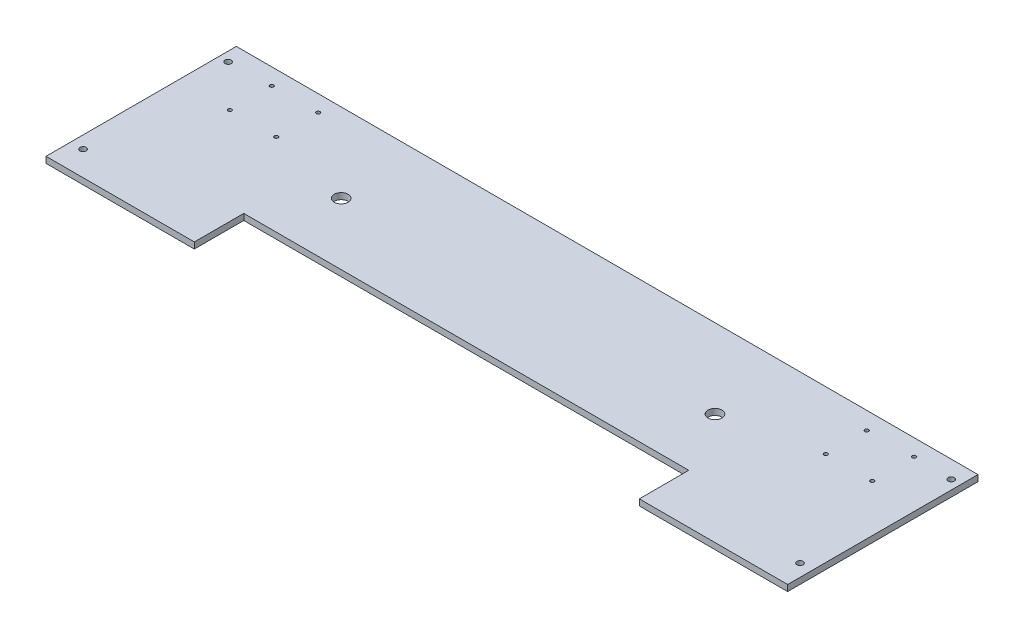
ISO-10303-21;
HEADER;
FILE_DESCRIPTION(('STEP AP214'),'2;1');
FILE_NAME('part.step','',(''),(''),'','','');
FILE_SCHEMA(('AUTOMOTIVE_DESIGN { 1 0 10303 214 1 1 1 1 }'));
ENDSEC;
DATA;
#1=APPLICATION_CONTEXT('core data for automotive mechanical design processes');
#2=APPLICATION_PROTOCOL_DEFINITION('international standard','automotive_design',2000,#1);
#3=PRODUCT_CONTEXT('',#1,'mechanical');
#4=PRODUCT('Part','Part','',(#3));
#5=PRODUCT_RELATED_PRODUCT_CATEGORY('part','',(#4));
#6=PRODUCT_DEFINITION_FORMATION('','',#4);
#7=PRODUCT_DEFINITION_CONTEXT('part definition',#1,'design');
#8=PRODUCT_DEFINITION('design','',#6,#7);
#9=PRODUCT_DEFINITION_SHAPE('','',#8);
#10=(LENGTH_UNIT() NAMED_UNIT(*) SI_UNIT(.MILLI.,.METRE.));
#11=(NAMED_UNIT(*) PLANE_ANGLE_UNIT() SI_UNIT($,.RADIAN.));
#12=(NAMED_UNIT(*) SI_UNIT($,.STERADIAN.) SOLID_ANGLE_UNIT());
#13=UNCERTAINTY_MEASURE_WITH_UNIT(LENGTH_MEASURE(1.E-05),#10,'distance_accuracy_value','');
#14=(GEOMETRIC_REPRESENTATION_CONTEXT(3) GLOBAL_UNCERTAINTY_ASSIGNED_CONTEXT((#13)) GLOBAL_UNIT_ASSIGNED_CONTEXT((#10,
#11,#12)) REPRESENTATION_CONTEXT('',''));
#15=CARTESIAN_POINT('',(0.,0.,0.));
#16=DIRECTION('',(0.,0.,1.));
#17=DIRECTION('',(1.,0.,0.));
#18=AXIS2_PLACEMENT_3D('',#15,#16,#17);
#19=CARTESIAN_POINT('',(609.6,6.35,50.7999999999986));
#20=DIRECTION('',(-1.,0.,0.));
#21=DIRECTION('',(0.,0.,1.));
#22=AXIS2_PLACEMENT_3D('',#19,#20,#21);
#23=PLANE('',#22);
#24=DIRECTION('',(0.,0.,-1.));
#25=VECTOR('',#24,1.);
#26=CARTESIAN_POINT('',(609.6,0.,50.7999999999986));
#27=LINE('',#26,#25);
#28=CARTESIAN_POINT('',(609.6,0.,50.7999999999986));
#29=VERTEX_POINT('',#28);
#30=CARTESIAN_POINT('',(609.6,0.,-144.780000000001));
#31=VERTEX_POINT('',#30);
#32=EDGE_CURVE('E131',#29,#31,#27,.T.);
#33=ORIENTED_EDGE('',*,*,#32,.T.);
#34=DIRECTION('',(0.,-1.,0.));
#35=VECTOR('',#34,1.);
#36=CARTESIAN_POINT('',(609.6,6.35,-144.780000000001));
#37=LINE('',#36,#35);
#38=CARTESIAN_POINT('',(609.6,6.35,-144.780000000001));
#39=VERTEX_POINT('',#38);
#40=EDGE_CURVE('E11',#39,#31,#37,.T.);
#41=ORIENTED_EDGE('',*,*,#40,.F.);
#42=DIRECTION('',(0.,0.,-1.));
#43=VECTOR('',#42,1.);
#44=CARTESIAN_POINT('',(609.6,6.35,50.7999999999986));
#45=LINE('',#44,#43);
#46=CARTESIAN_POINT('',(609.6,6.35,50.7999999999986));
#47=VERTEX_POINT('',#46);
#48=EDGE_CURVE('E150',#47,#39,#45,.T.);
#49=ORIENTED_EDGE('',*,*,#48,.F.);
#50=DIRECTION('',(0.,-1.,0.));
#51=VECTOR('',#50,1.);
#52=CARTESIAN_POINT('',(609.6,6.35,50.7999999999986));
#53=LINE('',#52,#51);
#54=EDGE_CURVE('E127',#47,#29,#53,.T.);
#55=ORIENTED_EDGE('',*,*,#54,.T.);
#56=EDGE_LOOP('',(#33,#41,#49,#55));
#57=FACE_BOUND('',#56,.T.);
#58=ADVANCED_FACE('F33',(#57),#23,.F.);
#59=CARTESIAN_POINT('',(609.6,6.35,-144.780000000001));
#60=DIRECTION('',(0.,0.,1.));
#61=DIRECTION('',(1.,0.,0.));
#62=AXIS2_PLACEMENT_3D('',#59,#60,#61);
#63=PLANE('',#62);
#64=DIRECTION('',(-1.,0.,0.));
#65=VECTOR('',#64,1.);
#66=CARTESIAN_POINT('',(609.6,0.,-144.780000000001));
#67=LINE('',#66,#65);
#68=CARTESIAN_POINT('',(-152.4,0.,-144.78));
#69=VERTEX_POINT('',#68);
#70=EDGE_CURVE('E134',#31,#69,#67,.T.);
#71=ORIENTED_EDGE('',*,*,#70,.T.);
#72=DIRECTION('',(0.,-1.,0.));
#73=VECTOR('',#72,1.);
#74=CARTESIAN_POINT('',(-152.4,6.35,-144.78));
#75=LINE('',#74,#73);
#76=CARTESIAN_POINT('',(-152.4,6.35,-144.78));
#77=VERTEX_POINT('',#76);
#78=EDGE_CURVE('E42',#77,#69,#75,.T.);
#79=ORIENTED_EDGE('',*,*,#78,.F.);
#80=DIRECTION('',(-1.,0.,0.));
#81=VECTOR('',#80,1.);
#82=CARTESIAN_POINT('',(609.6,6.35,-144.780000000001));
#83=LINE('',#82,#81);
#84=EDGE_CURVE('E94',#39,#77,#83,.T.);
#85=ORIENTED_EDGE('',*,*,#84,.F.);
#86=ORIENTED_EDGE('',*,*,#40,.T.);
#87=EDGE_LOOP('',(#71,#79,#85,#86));
#88=FACE_BOUND('',#87,.T.);
#89=ADVANCED_FACE('F272',(#88),#63,.F.);
#90=CARTESIAN_POINT('',(-152.4,6.35,50.8));
#91=DIRECTION('',(-1.,0.,0.));
#92=DIRECTION('',(0.,0.,1.));
#93=AXIS2_PLACEMENT_3D('',#90,#91,#92);
#94=PLANE('',#93);
#95=DIRECTION('',(0.,0.,-1.));
#96=VECTOR('',#95,1.);
#97=CARTESIAN_POINT('',(-152.4,0.,50.8));
#98=LINE('',#97,#96);
#99=CARTESIAN_POINT('',(-152.4,0.,50.8));
#100=VERTEX_POINT('',#99);
#101=EDGE_CURVE('E138',#100,#69,#98,.T.);
#102=ORIENTED_EDGE('',*,*,#101,.F.);
#103=DIRECTION('',(0.,-1.,0.));
#104=VECTOR('',#103,1.);
#105=CARTESIAN_POINT('',(-152.4,6.35,50.8));
#106=LINE('',#105,#104);
#107=CARTESIAN_POINT('',(-152.4,6.35,50.8));
#108=VERTEX_POINT('',#107);
#109=EDGE_CURVE('E156',#108,#100,#106,.T.);
#110=ORIENTED_EDGE('',*,*,#109,.F.);
#111=DIRECTION('',(0.,0.,-1.));
#112=VECTOR('',#111,1.);
#113=CARTESIAN_POINT('',(-152.4,6.35,50.8));
#114=LINE('',#113,#112);
#115=EDGE_CURVE('E244',#108,#77,#114,.T.);
#116=ORIENTED_EDGE('',*,*,#115,.T.);
#117=ORIENTED_EDGE('',*,*,#78,.T.);
#118=EDGE_LOOP('',(#102,#110,#116,#117));
#119=FACE_BOUND('',#118,.T.);
#120=ADVANCED_FACE('F276',(#119),#94,.T.);
#121=CARTESIAN_POINT('',(2.48065457064683E-13,6.35,50.7999999999999));
#122=DIRECTION('',(0.,0.,1.));
#123=DIRECTION('',(1.,0.,0.));
#124=AXIS2_PLACEMENT_3D('',#121,#122,#123);
#125=PLANE('',#124);
#126=DIRECTION('',(-1.,0.,0.));
#127=VECTOR('',#126,1.);
#128=CARTESIAN_POINT('',(2.48065457064683E-13,0.,50.7999999999999));
#129=LINE('',#128,#127);
#130=CARTESIAN_POINT('',(2.48065457064683E-13,0.,50.7999999999999));
#131=VERTEX_POINT('',#130);
#132=EDGE_CURVE('E141',#131,#100,#129,.T.);
#133=ORIENTED_EDGE('',*,*,#132,.F.);
#134=DIRECTION('',(0.,-1.,0.));
#135=VECTOR('',#134,1.);
#136=CARTESIAN_POINT('',(2.48065457064683E-13,6.35,50.7999999999999));
#137=LINE('',#136,#135);
#138=CARTESIAN_POINT('',(2.48065457064683E-13,6.35,50.7999999999999));
#139=VERTEX_POINT('',#138);
#140=EDGE_CURVE('E154',#139,#131,#137,.T.);
#141=ORIENTED_EDGE('',*,*,#140,.F.);
#142=DIRECTION('',(-1.,0.,0.));
#143=VECTOR('',#142,1.);
#144=CARTESIAN_POINT('',(2.48065457064683E-13,6.35,50.7999999999999));
#145=LINE('',#144,#143);
#146=EDGE_CURVE('E247',#139,#108,#145,.T.);
#147=ORIENTED_EDGE('',*,*,#146,.T.);
#148=ORIENTED_EDGE('',*,*,#109,.T.);
#149=EDGE_LOOP('',(#133,#141,#147,#148));
#150=FACE_BOUND('',#149,.T.);
#151=ADVANCED_FACE('F280',(#150),#125,.T.);
#152=CARTESIAN_POINT('',(0.,6.35,0.));
#153=DIRECTION('',(1.,0.,0.));
#154=DIRECTION('',(0.,0.,-1.));
#155=AXIS2_PLACEMENT_3D('',#152,#153,#154);
#156=PLANE('',#155);
#157=DIRECTION('',(0.,0.,1.));
#158=VECTOR('',#157,1.);
#159=CARTESIAN_POINT('',(0.,0.,0.));
#160=LINE('',#159,#158);
#161=CARTESIAN_POINT('',(0.,0.,0.));
#162=VERTEX_POINT('',#161);
#163=EDGE_CURVE('E144',#162,#131,#160,.T.);
#164=ORIENTED_EDGE('',*,*,#163,.F.);
#165=DIRECTION('',(0.,-1.,0.));
#166=VECTOR('',#165,1.);
#167=CARTESIAN_POINT('',(0.,6.35,0.));
#168=LINE('',#167,#166);
#169=CARTESIAN_POINT('',(0.,6.35,0.));
#170=VERTEX_POINT('',#169);
#171=EDGE_CURVE('E122',#170,#162,#168,.T.);
#172=ORIENTED_EDGE('',*,*,#171,.F.);
#173=DIRECTION('',(0.,0.,1.));
#174=VECTOR('',#173,1.);
#175=CARTESIAN_POINT('',(0.,6.35,0.));
#176=LINE('',#175,#174);
#177=EDGE_CURVE('E115',#170,#139,#176,.T.);
#178=ORIENTED_EDGE('',*,*,#177,.T.);
#179=ORIENTED_EDGE('',*,*,#140,.T.);
#180=EDGE_LOOP('',(#164,#172,#178,#179));
#181=FACE_BOUND('',#180,.T.);
#182=ADVANCED_FACE('F251',(#181),#156,.T.);
#183=CARTESIAN_POINT('',(0.,6.35,0.));
#184=DIRECTION('',(0.,0.,-1.));
#185=DIRECTION('',(-1.,0.,0.));
#186=AXIS2_PLACEMENT_3D('',#183,#184,#185);
#187=PLANE('',#186);
#188=DIRECTION('',(1.,0.,0.));
#189=VECTOR('',#188,1.);
#190=CARTESIAN_POINT('',(0.,0.,0.));
#191=LINE('',#190,#189);
#192=CARTESIAN_POINT('',(457.2,0.,-1.33573707650214E-13));
#193=VERTEX_POINT('',#192);
#194=EDGE_CURVE('E121',#162,#193,#191,.T.);
#195=ORIENTED_EDGE('',*,*,#194,.T.);
#196=DIRECTION('',(0.,-1.,0.));
#197=VECTOR('',#196,1.);
#198=CARTESIAN_POINT('',(457.2,6.35,-1.33573707650214E-13));
#199=LINE('',#198,#197);
#200=CARTESIAN_POINT('',(457.2,6.35,-1.33573707650214E-13));
#201=VERTEX_POINT('',#200);
#202=EDGE_CURVE('E118',#201,#193,#199,.T.);
#203=ORIENTED_EDGE('',*,*,#202,.F.);
#204=DIRECTION('',(1.,0.,0.));
#205=VECTOR('',#204,1.);
#206=CARTESIAN_POINT('',(0.,6.35,0.));
#207=LINE('',#206,#205);
#208=EDGE_CURVE('E108',#170,#201,#207,.T.);
#209=ORIENTED_EDGE('',*,*,#208,.F.);
#210=ORIENTED_EDGE('',*,*,#171,.T.);
#211=EDGE_LOOP('',(#195,#203,#209,#210));
#212=FACE_BOUND('',#211,.T.);
#213=ADVANCED_FACE('F119',(#212),#187,.F.);
#214=CARTESIAN_POINT('',(457.2,6.35,-1.33573707650214E-13));
#215=DIRECTION('',(1.,0.,0.));
#216=DIRECTION('',(0.,0.,-1.));
#217=AXIS2_PLACEMENT_3D('',#214,#215,#216);
#218=PLANE('',#217);
#219=DIRECTION('',(0.,0.,1.));
#220=VECTOR('',#219,1.);
#221=CARTESIAN_POINT('',(457.2,0.,-1.33573707650214E-13));
#222=LINE('',#221,#220);
#223=CARTESIAN_POINT('',(457.2,0.,50.7999999999988));
#224=VERTEX_POINT('',#223);
#225=EDGE_CURVE('E80',#193,#224,#222,.T.);
#226=ORIENTED_EDGE('',*,*,#225,.T.);
#227=DIRECTION('',(0.,-1.,0.));
#228=VECTOR('',#227,1.);
#229=CARTESIAN_POINT('',(457.2,6.35,50.7999999999988));
#230=LINE('',#229,#228);
#231=CARTESIAN_POINT('',(457.2,6.35,50.7999999999988));
#232=VERTEX_POINT('',#231);
#233=EDGE_CURVE('E123',#232,#224,#230,.T.);
#234=ORIENTED_EDGE('',*,*,#233,.F.);
#235=DIRECTION('',(0.,0.,1.));
#236=VECTOR('',#235,1.);
#237=CARTESIAN_POINT('',(457.2,6.35,-1.33573707650214E-13));
#238=LINE('',#237,#236);
#239=EDGE_CURVE('E112',#201,#232,#238,.T.);
#240=ORIENTED_EDGE('',*,*,#239,.F.);
#241=ORIENTED_EDGE('',*,*,#202,.T.);
#242=EDGE_LOOP('',(#226,#234,#240,#241));
#243=FACE_BOUND('',#242,.T.);
#244=ADVANCED_FACE('F125',(#243),#218,.F.);
#245=CARTESIAN_POINT('',(457.2,6.35,50.7999999999988));
#246=DIRECTION('',(0.,0.,-1.));
#247=DIRECTION('',(-1.,0.,0.));
#248=AXIS2_PLACEMENT_3D('',#245,#246,#247);
#249=PLANE('',#248);
#250=DIRECTION('',(1.,0.,0.));
#251=VECTOR('',#250,1.);
#252=CARTESIAN_POINT('',(457.2,0.,50.7999999999988));
#253=LINE('',#252,#251);
#254=EDGE_CURVE('E86',#224,#29,#253,.T.);
#255=ORIENTED_EDGE('',*,*,#254,.T.);
#256=ORIENTED_EDGE('',*,*,#54,.F.);
#257=DIRECTION('',(1.,0.,0.));
#258=VECTOR('',#257,1.);
#259=CARTESIAN_POINT('',(457.2,6.35,50.7999999999988));
#260=LINE('',#259,#258);
#261=EDGE_CURVE('E51',#232,#47,#260,.T.);
#262=ORIENTED_EDGE('',*,*,#261,.F.);
#263=ORIENTED_EDGE('',*,*,#233,.T.);
#264=EDGE_LOOP('',(#255,#256,#262,#263));
#265=FACE_BOUND('',#264,.T.);
#266=ADVANCED_FACE('F259',(#265),#249,.F.);
#267=CARTESIAN_POINT('',(0.,6.35,0.));
#268=DIRECTION('',(0.,1.,0.));
#269=DIRECTION('',(0.,0.,1.));
#270=AXIS2_PLACEMENT_3D('',#267,#268,#269);
#271=PLANE('',#270);
#272=CARTESIAN_POINT('',(420.624,6.35,-63.5000000000014));
#273=DIRECTION('',(0.,1.,0.));
#274=DIRECTION('',(0.,0.,1.));
#275=AXIS2_PLACEMENT_3D('',#272,#273,#274);
#276=CIRCLE('',#275,7.14375000000002);
#277=CARTESIAN_POINT('',(420.624,6.35,-56.3562500000014));
#278=VERTEX_POINT('',#277);
#279=EDGE_CURVE('E217',#278,#278,#276,.T.);
#280=ORIENTED_EDGE('',*,*,#279,.F.);
#281=EDGE_LOOP('',(#280));
#282=FACE_BOUND('',#281,.T.);
#283=CARTESIAN_POINT('',(513.207000000001,6.35,-126.817120000001));
#284=DIRECTION('',(0.,1.,0.));
#285=DIRECTION('',(0.,0.,1.));
#286=AXIS2_PLACEMENT_3D('',#283,#284,#285);
#287=CIRCLE('',#286,1.90500000000005);
#288=CARTESIAN_POINT('',(513.207000000001,6.35,-124.912120000001));
#289=VERTEX_POINT('',#288);
#290=EDGE_CURVE('E207',#289,#289,#287,.T.);
#291=ORIENTED_EDGE('',*,*,#290,.F.);
#292=EDGE_LOOP('',(#291));
#293=FACE_BOUND('',#292,.T.);
#294=CARTESIAN_POINT('',(560.959,6.35,-84.8106000000014));
#295=DIRECTION('',(0.,1.,0.));
#296=DIRECTION('',(0.,0.,1.));
#297=AXIS2_PLACEMENT_3D('',#294,#295,#296);
#298=CIRCLE('',#297,1.90500000000005);
#299=CARTESIAN_POINT('',(560.959,6.35,-82.9056000000013));
#300=VERTEX_POINT('',#299);
#301=EDGE_CURVE('E204',#300,#300,#298,.T.);
#302=ORIENTED_EDGE('',*,*,#301,.F.);
#303=EDGE_LOOP('',(#302));
#304=FACE_BOUND('',#303,.T.);
#305=CARTESIAN_POINT('',(513.207000000001,6.35,-84.8106000000014));
#306=DIRECTION('',(0.,1.,0.));
#307=DIRECTION('',(0.,0.,1.));
#308=AXIS2_PLACEMENT_3D('',#305,#306,#307);
#309=CIRCLE('',#308,1.90500000000005);
#310=CARTESIAN_POINT('',(513.207000000001,6.35,-82.9056000000013));
#311=VERTEX_POINT('',#310);
#312=EDGE_CURVE('E201',#311,#311,#309,.T.);
#313=ORIENTED_EDGE('',*,*,#312,.F.);
#314=EDGE_LOOP('',(#313));
#315=FACE_BOUND('',#314,.T.);
#316=CARTESIAN_POINT('',(560.959,6.35,-127.863600000001));
#317=DIRECTION('',(0.,1.,0.));
#318=DIRECTION('',(0.,0.,1.));
#319=AXIS2_PLACEMENT_3D('',#316,#317,#318);
#320=CIRCLE('',#319,1.90500000000005);
#321=CARTESIAN_POINT('',(560.959,6.35,-125.958600000001));
#322=VERTEX_POINT('',#321);
#323=EDGE_CURVE('E197',#322,#322,#320,.T.);
#324=ORIENTED_EDGE('',*,*,#323,.F.);
#325=EDGE_LOOP('',(#324));
#326=FACE_BOUND('',#325,.T.);
#327=CARTESIAN_POINT('',(596.9,6.35,25.3999999999988));
#328=DIRECTION('',(0.,1.,0.));
#329=DIRECTION('',(0.,0.,1.));
#330=AXIS2_PLACEMENT_3D('',#327,#328,#329);
#331=CIRCLE('',#330,3.17500000000008);
#332=CARTESIAN_POINT('',(596.9,6.35,28.5749999999989));
#333=VERTEX_POINT('',#332);
#334=EDGE_CURVE('E193',#333,#333,#331,.T.);
#335=ORIENTED_EDGE('',*,*,#334,.F.);
#336=EDGE_LOOP('',(#335));
#337=FACE_BOUND('',#336,.T.);
#338=CARTESIAN_POINT('',(600.075000000001,6.35,-126.817120000001));
#339=DIRECTION('',(0.,1.,0.));
#340=DIRECTION('',(0.,0.,1.));
#341=AXIS2_PLACEMENT_3D('',#338,#339,#340);
#342=CIRCLE('',#341,3.17500000000009);
#343=CARTESIAN_POINT('',(600.075000000001,6.35,-123.642120000001));
#344=VERTEX_POINT('',#343);
#345=EDGE_CURVE('E189',#344,#344,#342,.T.);
#346=ORIENTED_EDGE('',*,*,#345,.F.);
#347=EDGE_LOOP('',(#346));
#348=FACE_BOUND('',#347,.T.);
#349=CARTESIAN_POINT('',(-99.1107999999998,6.35,-127.863600000001));
#350=DIRECTION('',(0.,1.,0.));
#351=DIRECTION('',(0.,0.,1.));
#352=AXIS2_PLACEMENT_3D('',#349,#350,#351);
#353=CIRCLE('',#352,1.905);
#354=CARTESIAN_POINT('',(-99.1107999999998,6.35,-125.958600000001));
#355=VERTEX_POINT('',#354);
#356=EDGE_CURVE('E185',#355,#355,#353,.T.);
#357=ORIENTED_EDGE('',*,*,#356,.F.);
#358=EDGE_LOOP('',(#357));
#359=FACE_BOUND('',#358,.T.);
#360=CARTESIAN_POINT('',(36.5760000000002,6.35,-63.5));
#361=DIRECTION('',(0.,1.,0.));
#362=DIRECTION('',(0.,0.,1.));
#363=AXIS2_PLACEMENT_3D('',#360,#361,#362);
#364=CIRCLE('',#363,7.14375);
#365=CARTESIAN_POINT('',(36.5760000000002,6.35,-56.35625));
#366=VERTEX_POINT('',#365);
#367=EDGE_CURVE('E181',#366,#366,#364,.T.);
#368=ORIENTED_EDGE('',*,*,#367,.F.);
#369=EDGE_LOOP('',(#368));
#370=FACE_BOUND('',#369,.T.);
#371=CARTESIAN_POINT('',(-51.4349999999998,6.35,-127.863600000001));
#372=DIRECTION('',(0.,1.,0.));
#373=DIRECTION('',(0.,0.,1.));
#374=AXIS2_PLACEMENT_3D('',#371,#372,#373);
#375=CIRCLE('',#374,1.905);
#376=CARTESIAN_POINT('',(-51.4349999999998,6.35,-125.958600000001));
#377=VERTEX_POINT('',#376);
#378=EDGE_CURVE('E177',#377,#377,#375,.T.);
#379=ORIENTED_EDGE('',*,*,#378,.F.);
#380=EDGE_LOOP('',(#379));
#381=FACE_BOUND('',#380,.T.);
#382=CARTESIAN_POINT('',(-51.4349999999998,6.35,-84.8106000000014));
#383=DIRECTION('',(0.,1.,0.));
#384=DIRECTION('',(0.,0.,1.));
#385=AXIS2_PLACEMENT_3D('',#382,#383,#384);
#386=CIRCLE('',#385,1.90500000000001);
#387=CARTESIAN_POINT('',(-51.4349999999998,6.35,-82.9056000000014));
#388=VERTEX_POINT('',#387);
#389=EDGE_CURVE('E173',#388,#388,#386,.T.);
#390=ORIENTED_EDGE('',*,*,#389,.F.);
#391=EDGE_LOOP('',(#390));
#392=FACE_BOUND('',#391,.T.);
#393=CARTESIAN_POINT('',(-142.875,6.35,-126.817120000001));
#394=DIRECTION('',(0.,1.,0.));
#395=DIRECTION('',(0.,0.,1.));
#396=AXIS2_PLACEMENT_3D('',#393,#394,#395);
#397=CIRCLE('',#396,3.175);
#398=CARTESIAN_POINT('',(-142.875,6.35,-123.642120000001));
#399=VERTEX_POINT('',#398);
#400=EDGE_CURVE('E169',#399,#399,#397,.T.);
#401=ORIENTED_EDGE('',*,*,#400,.F.);
#402=EDGE_LOOP('',(#401));
#403=FACE_BOUND('',#402,.T.);
#404=CARTESIAN_POINT('',(-99.1107999999998,6.35,-84.8106000000014));
#405=DIRECTION('',(0.,1.,0.));
#406=DIRECTION('',(0.,0.,1.));
#407=AXIS2_PLACEMENT_3D('',#404,#405,#406);
#408=CIRCLE('',#407,1.90500000000001);
#409=CARTESIAN_POINT('',(-99.1107999999998,6.35,-82.9056000000014));
#410=VERTEX_POINT('',#409);
#411=EDGE_CURVE('E165',#410,#410,#408,.T.);
#412=ORIENTED_EDGE('',*,*,#411,.F.);
#413=EDGE_LOOP('',(#412));
#414=FACE_BOUND('',#413,.T.);
#415=CARTESIAN_POINT('',(-139.7,6.35,25.3999999999999));
#416=DIRECTION('',(0.,1.,0.));
#417=DIRECTION('',(0.,0.,1.));
#418=AXIS2_PLACEMENT_3D('',#415,#416,#417);
#419=CIRCLE('',#418,3.175);
#420=CARTESIAN_POINT('',(-139.7,6.35,28.5749999999999));
#421=VERTEX_POINT('',#420);
#422=EDGE_CURVE('E161',#421,#421,#419,.T.);
#423=ORIENTED_EDGE('',*,*,#422,.F.);
#424=EDGE_LOOP('',(#423));
#425=FACE_BOUND('',#424,.T.);
#426=ORIENTED_EDGE('',*,*,#48,.T.);
#427=ORIENTED_EDGE('',*,*,#84,.T.);
#428=ORIENTED_EDGE('',*,*,#115,.F.);
#429=ORIENTED_EDGE('',*,*,#146,.F.);
#430=ORIENTED_EDGE('',*,*,#177,.F.);
#431=ORIENTED_EDGE('',*,*,#208,.T.);
#432=ORIENTED_EDGE('',*,*,#239,.T.);
#433=ORIENTED_EDGE('',*,*,#261,.T.);
#434=EDGE_LOOP('',(#426,#427,#428,#429,#430,#431,#432,#433));
#435=FACE_BOUND('',#434,.T.);
#436=ADVANCED_FACE('F110',(#282,#293,#304,#315,#326,#337,#348,#359,#370,#381,#392,#403,#414,
#425,#435),#271,.T.);
#437=CARTESIAN_POINT('',(0.,0.,0.));
#438=DIRECTION('',(0.,1.,0.));
#439=DIRECTION('',(0.,0.,1.));
#440=AXIS2_PLACEMENT_3D('',#437,#438,#439);
#441=PLANE('',#440);
#442=CARTESIAN_POINT('',(420.624,0.,-63.5000000000014));
#443=DIRECTION('',(0.,1.,0.));
#444=DIRECTION('',(0.,0.,1.));
#445=AXIS2_PLACEMENT_3D('',#442,#443,#444);
#446=CIRCLE('',#445,7.14375000000002);
#447=CARTESIAN_POINT('',(420.624,0.,-56.3562500000014));
#448=VERTEX_POINT('',#447);
#449=EDGE_CURVE('E36',#448,#448,#446,.T.);
#450=ORIENTED_EDGE('',*,*,#449,.T.);
#451=EDGE_LOOP('',(#450));
#452=FACE_BOUND('',#451,.T.);
#453=CARTESIAN_POINT('',(513.207000000001,0.,-126.817120000001));
#454=DIRECTION('',(0.,1.,0.));
#455=DIRECTION('',(0.,0.,1.));
#456=AXIS2_PLACEMENT_3D('',#453,#454,#455);
#457=CIRCLE('',#456,1.90500000000005);
#458=CARTESIAN_POINT('',(513.207000000001,0.,-124.912120000001));
#459=VERTEX_POINT('',#458);
#460=EDGE_CURVE('E205',#459,#459,#457,.T.);
#461=ORIENTED_EDGE('',*,*,#460,.T.);
#462=EDGE_LOOP('',(#461));
#463=FACE_BOUND('',#462,.T.);
#464=CARTESIAN_POINT('',(560.959,0.,-84.8106000000014));
#465=DIRECTION('',(0.,1.,0.));
#466=DIRECTION('',(0.,0.,1.));
#467=AXIS2_PLACEMENT_3D('',#464,#465,#466);
#468=CIRCLE('',#467,1.90500000000005);
#469=CARTESIAN_POINT('',(560.959,0.,-82.9056000000013));
#470=VERTEX_POINT('',#469);
#471=EDGE_CURVE('E202',#470,#470,#468,.T.);
#472=ORIENTED_EDGE('',*,*,#471,.T.);
#473=EDGE_LOOP('',(#472));
#474=FACE_BOUND('',#473,.T.);
#475=CARTESIAN_POINT('',(513.207000000001,0.,-84.8106000000014));
#476=DIRECTION('',(0.,1.,0.));
#477=DIRECTION('',(0.,0.,1.));
#478=AXIS2_PLACEMENT_3D('',#475,#476,#477);
#479=CIRCLE('',#478,1.90500000000005);
#480=CARTESIAN_POINT('',(513.207000000001,0.,-82.9056000000013));
#481=VERTEX_POINT('',#480);
#482=EDGE_CURVE('E198',#481,#481,#479,.T.);
#483=ORIENTED_EDGE('',*,*,#482,.T.);
#484=EDGE_LOOP('',(#483));
#485=FACE_BOUND('',#484,.T.);
#486=CARTESIAN_POINT('',(560.959,0.,-127.863600000001));
#487=DIRECTION('',(0.,1.,0.));
#488=DIRECTION('',(0.,0.,1.));
#489=AXIS2_PLACEMENT_3D('',#486,#487,#488);
#490=CIRCLE('',#489,1.90500000000005);
#491=CARTESIAN_POINT('',(560.959,0.,-125.958600000001));
#492=VERTEX_POINT('',#491);
#493=EDGE_CURVE('E194',#492,#492,#490,.T.);
#494=ORIENTED_EDGE('',*,*,#493,.T.);
#495=EDGE_LOOP('',(#494));
#496=FACE_BOUND('',#495,.T.);
#497=CARTESIAN_POINT('',(596.9,0.,25.3999999999988));
#498=DIRECTION('',(0.,1.,0.));
#499=DIRECTION('',(0.,0.,1.));
#500=AXIS2_PLACEMENT_3D('',#497,#498,#499);
#501=CIRCLE('',#500,3.17500000000008);
#502=CARTESIAN_POINT('',(596.9,0.,28.5749999999989));
#503=VERTEX_POINT('',#502);
#504=EDGE_CURVE('E190',#503,#503,#501,.T.);
#505=ORIENTED_EDGE('',*,*,#504,.T.);
#506=EDGE_LOOP('',(#505));
#507=FACE_BOUND('',#506,.T.);
#508=CARTESIAN_POINT('',(600.075000000001,0.,-126.817120000001));
#509=DIRECTION('',(0.,1.,0.));
#510=DIRECTION('',(0.,0.,1.));
#511=AXIS2_PLACEMENT_3D('',#508,#509,#510);
#512=CIRCLE('',#511,3.17500000000009);
#513=CARTESIAN_POINT('',(600.075000000001,0.,-123.642120000001));
#514=VERTEX_POINT('',#513);
#515=EDGE_CURVE('E186',#514,#514,#512,.T.);
#516=ORIENTED_EDGE('',*,*,#515,.T.);
#517=EDGE_LOOP('',(#516));
#518=FACE_BOUND('',#517,.T.);
#519=CARTESIAN_POINT('',(-99.1107999999998,0.,-127.863600000001));
#520=DIRECTION('',(0.,1.,0.));
#521=DIRECTION('',(0.,0.,1.));
#522=AXIS2_PLACEMENT_3D('',#519,#520,#521);
#523=CIRCLE('',#522,1.905);
#524=CARTESIAN_POINT('',(-99.1107999999998,0.,-125.958600000001));
#525=VERTEX_POINT('',#524);
#526=EDGE_CURVE('E182',#525,#525,#523,.T.);
#527=ORIENTED_EDGE('',*,*,#526,.T.);
#528=EDGE_LOOP('',(#527));
#529=FACE_BOUND('',#528,.T.);
#530=CARTESIAN_POINT('',(36.5760000000002,0.,-63.5));
#531=DIRECTION('',(0.,1.,0.));
#532=DIRECTION('',(0.,0.,1.));
#533=AXIS2_PLACEMENT_3D('',#530,#531,#532);
#534=CIRCLE('',#533,7.14375);
#535=CARTESIAN_POINT('',(36.5760000000002,0.,-56.35625));
#536=VERTEX_POINT('',#535);
#537=EDGE_CURVE('E178',#536,#536,#534,.T.);
#538=ORIENTED_EDGE('',*,*,#537,.T.);
#539=EDGE_LOOP('',(#538));
#540=FACE_BOUND('',#539,.T.);
#541=CARTESIAN_POINT('',(-51.4349999999998,0.,-127.863600000001));
#542=DIRECTION('',(0.,1.,0.));
#543=DIRECTION('',(0.,0.,1.));
#544=AXIS2_PLACEMENT_3D('',#541,#542,#543);
#545=CIRCLE('',#544,1.905);
#546=CARTESIAN_POINT('',(-51.4349999999998,0.,-125.958600000001));
#547=VERTEX_POINT('',#546);
#548=EDGE_CURVE('E174',#547,#547,#545,.T.);
#549=ORIENTED_EDGE('',*,*,#548,.T.);
#550=EDGE_LOOP('',(#549));
#551=FACE_BOUND('',#550,.T.);
#552=CARTESIAN_POINT('',(-51.4349999999998,0.,-84.8106000000014));
#553=DIRECTION('',(0.,1.,0.));
#554=DIRECTION('',(0.,0.,1.));
#555=AXIS2_PLACEMENT_3D('',#552,#553,#554);
#556=CIRCLE('',#555,1.90500000000001);
#557=CARTESIAN_POINT('',(-51.4349999999998,0.,-82.9056000000014));
#558=VERTEX_POINT('',#557);
#559=EDGE_CURVE('E170',#558,#558,#556,.T.);
#560=ORIENTED_EDGE('',*,*,#559,.T.);
#561=EDGE_LOOP('',(#560));
#562=FACE_BOUND('',#561,.T.);
#563=CARTESIAN_POINT('',(-142.875,0.,-126.817120000001));
#564=DIRECTION('',(0.,1.,0.));
#565=DIRECTION('',(0.,0.,1.));
#566=AXIS2_PLACEMENT_3D('',#563,#564,#565);
#567=CIRCLE('',#566,3.175);
#568=CARTESIAN_POINT('',(-142.875,0.,-123.642120000001));
#569=VERTEX_POINT('',#568);
#570=EDGE_CURVE('E166',#569,#569,#567,.T.);
#571=ORIENTED_EDGE('',*,*,#570,.T.);
#572=EDGE_LOOP('',(#571));
#573=FACE_BOUND('',#572,.T.);
#574=CARTESIAN_POINT('',(-99.1107999999998,0.,-84.8106000000014));
#575=DIRECTION('',(0.,1.,0.));
#576=DIRECTION('',(0.,0.,1.));
#577=AXIS2_PLACEMENT_3D('',#574,#575,#576);
#578=CIRCLE('',#577,1.90500000000001);
#579=CARTESIAN_POINT('',(-99.1107999999998,0.,-82.9056000000014));
#580=VERTEX_POINT('',#579);
#581=EDGE_CURVE('E162',#580,#580,#578,.T.);
#582=ORIENTED_EDGE('',*,*,#581,.T.);
#583=EDGE_LOOP('',(#582));
#584=FACE_BOUND('',#583,.T.);
#585=CARTESIAN_POINT('',(-139.7,0.,25.3999999999999));
#586=DIRECTION('',(0.,1.,0.));
#587=DIRECTION('',(0.,0.,1.));
#588=AXIS2_PLACEMENT_3D('',#585,#586,#587);
#589=CIRCLE('',#588,3.175);
#590=CARTESIAN_POINT('',(-139.7,0.,28.5749999999999));
#591=VERTEX_POINT('',#590);
#592=EDGE_CURVE('E135',#591,#591,#589,.T.);
#593=ORIENTED_EDGE('',*,*,#592,.T.);
#594=EDGE_LOOP('',(#593));
#595=FACE_BOUND('',#594,.T.);
#596=ORIENTED_EDGE('',*,*,#32,.F.);
#597=ORIENTED_EDGE('',*,*,#254,.F.);
#598=ORIENTED_EDGE('',*,*,#225,.F.);
#599=ORIENTED_EDGE('',*,*,#194,.F.);
#600=ORIENTED_EDGE('',*,*,#163,.T.);
#601=ORIENTED_EDGE('',*,*,#132,.T.);
#602=ORIENTED_EDGE('',*,*,#101,.T.);
#603=ORIENTED_EDGE('',*,*,#70,.F.);
#604=EDGE_LOOP('',(#596,#597,#598,#599,#600,#601,#602,#603));
#605=FACE_BOUND('',#604,.T.);
#606=ADVANCED_FACE('F255',(#452,#463,#474,#485,#496,#507,#518,#529,#540,#551,#562,#573,#584,
#595,#605),#441,.F.);
#607=CARTESIAN_POINT('',(-139.7,-1.27,25.3999999999999));
#608=DIRECTION('',(0.,1.,0.));
#609=DIRECTION('',(0.,0.,1.));
#610=AXIS2_PLACEMENT_3D('',#607,#608,#609);
#611=CYLINDRICAL_SURFACE('',#610,3.175);
#612=ORIENTED_EDGE('',*,*,#422,.T.);
#613=EDGE_LOOP('',(#612));
#614=FACE_BOUND('',#613,.T.);
#615=ORIENTED_EDGE('',*,*,#592,.F.);
#616=EDGE_LOOP('',(#615));
#617=FACE_BOUND('',#616,.T.);
#618=ADVANCED_FACE('F313',(#614,#617),#611,.F.);
#619=CARTESIAN_POINT('',(-99.1107999999998,-1.27,-84.8106000000014));
#620=DIRECTION('',(0.,1.,0.));
#621=DIRECTION('',(0.,0.,1.));
#622=AXIS2_PLACEMENT_3D('',#619,#620,#621);
#623=CYLINDRICAL_SURFACE('',#622,1.90500000000001);
#624=ORIENTED_EDGE('',*,*,#411,.T.);
#625=EDGE_LOOP('',(#624));
#626=FACE_BOUND('',#625,.T.);
#627=ORIENTED_EDGE('',*,*,#581,.F.);
#628=EDGE_LOOP('',(#627));
#629=FACE_BOUND('',#628,.T.);
#630=ADVANCED_FACE('F321',(#626,#629),#623,.F.);
#631=CARTESIAN_POINT('',(-142.875,-1.27,-126.817120000001));
#632=DIRECTION('',(0.,1.,0.));
#633=DIRECTION('',(0.,0.,1.));
#634=AXIS2_PLACEMENT_3D('',#631,#632,#633);
#635=CYLINDRICAL_SURFACE('',#634,3.175);
#636=ORIENTED_EDGE('',*,*,#400,.T.);
#637=EDGE_LOOP('',(#636));
#638=FACE_BOUND('',#637,.T.);
#639=ORIENTED_EDGE('',*,*,#570,.F.);
#640=EDGE_LOOP('',(#639));
#641=FACE_BOUND('',#640,.T.);
#642=ADVANCED_FACE('F331',(#638,#641),#635,.F.);
#643=CARTESIAN_POINT('',(-51.4349999999998,-1.27,-84.8106000000014));
#644=DIRECTION('',(0.,1.,0.));
#645=DIRECTION('',(0.,0.,1.));
#646=AXIS2_PLACEMENT_3D('',#643,#644,#645);
#647=CYLINDRICAL_SURFACE('',#646,1.90500000000001);
#648=ORIENTED_EDGE('',*,*,#389,.T.);
#649=EDGE_LOOP('',(#648));
#650=FACE_BOUND('',#649,.T.);
#651=ORIENTED_EDGE('',*,*,#559,.F.);
#652=EDGE_LOOP('',(#651));
#653=FACE_BOUND('',#652,.T.);
#654=ADVANCED_FACE('F341',(#650,#653),#647,.F.);
#655=CARTESIAN_POINT('',(-51.4349999999998,-1.27,-127.863600000001));
#656=DIRECTION('',(0.,1.,0.));
#657=DIRECTION('',(0.,0.,1.));
#658=AXIS2_PLACEMENT_3D('',#655,#656,#657);
#659=CYLINDRICAL_SURFACE('',#658,1.905);
#660=ORIENTED_EDGE('',*,*,#378,.T.);
#661=EDGE_LOOP('',(#660));
#662=FACE_BOUND('',#661,.T.);
#663=ORIENTED_EDGE('',*,*,#548,.F.);
#664=EDGE_LOOP('',(#663));
#665=FACE_BOUND('',#664,.T.);
#666=ADVANCED_FACE('F351',(#662,#665),#659,.F.);
#667=CARTESIAN_POINT('',(36.5760000000002,-1.27,-63.5));
#668=DIRECTION('',(0.,1.,0.));
#669=DIRECTION('',(0.,0.,1.));
#670=AXIS2_PLACEMENT_3D('',#667,#668,#669);
#671=CYLINDRICAL_SURFACE('',#670,7.14375);
#672=ORIENTED_EDGE('',*,*,#367,.T.);
#673=EDGE_LOOP('',(#672));
#674=FACE_BOUND('',#673,.T.);
#675=ORIENTED_EDGE('',*,*,#537,.F.);
#676=EDGE_LOOP('',(#675));
#677=FACE_BOUND('',#676,.T.);
#678=ADVANCED_FACE('F361',(#674,#677),#671,.F.);
#679=CARTESIAN_POINT('',(-99.1107999999998,-1.27,-127.863600000001));
#680=DIRECTION('',(0.,1.,0.));
#681=DIRECTION('',(0.,0.,1.));
#682=AXIS2_PLACEMENT_3D('',#679,#680,#681);
#683=CYLINDRICAL_SURFACE('',#682,1.905);
#684=ORIENTED_EDGE('',*,*,#356,.T.);
#685=EDGE_LOOP('',(#684));
#686=FACE_BOUND('',#685,.T.);
#687=ORIENTED_EDGE('',*,*,#526,.F.);
#688=EDGE_LOOP('',(#687));
#689=FACE_BOUND('',#688,.T.);
#690=ADVANCED_FACE('F371',(#686,#689),#683,.F.);
#691=CARTESIAN_POINT('',(600.075000000001,-1.27,-126.817120000001));
#692=DIRECTION('',(0.,1.,0.));
#693=DIRECTION('',(0.,0.,1.));
#694=AXIS2_PLACEMENT_3D('',#691,#692,#693);
#695=CYLINDRICAL_SURFACE('',#694,3.17500000000009);
#696=ORIENTED_EDGE('',*,*,#345,.T.);
#697=EDGE_LOOP('',(#696));
#698=FACE_BOUND('',#697,.T.);
#699=ORIENTED_EDGE('',*,*,#515,.F.);
#700=EDGE_LOOP('',(#699));
#701=FACE_BOUND('',#700,.T.);
#702=ADVANCED_FACE('F381',(#698,#701),#695,.F.);
#703=CARTESIAN_POINT('',(596.9,-1.27,25.3999999999988));
#704=DIRECTION('',(0.,1.,0.));
#705=DIRECTION('',(0.,0.,1.));
#706=AXIS2_PLACEMENT_3D('',#703,#704,#705);
#707=CYLINDRICAL_SURFACE('',#706,3.17500000000008);
#708=ORIENTED_EDGE('',*,*,#334,.T.);
#709=EDGE_LOOP('',(#708));
#710=FACE_BOUND('',#709,.T.);
#711=ORIENTED_EDGE('',*,*,#504,.F.);
#712=EDGE_LOOP('',(#711));
#713=FACE_BOUND('',#712,.T.);
#714=ADVANCED_FACE('F391',(#710,#713),#707,.F.);
#715=CARTESIAN_POINT('',(560.959,-1.27,-127.863600000001));
#716=DIRECTION('',(0.,1.,0.));
#717=DIRECTION('',(0.,0.,1.));
#718=AXIS2_PLACEMENT_3D('',#715,#716,#717);
#719=CYLINDRICAL_SURFACE('',#718,1.90500000000005);
#720=ORIENTED_EDGE('',*,*,#323,.T.);
#721=EDGE_LOOP('',(#720));
#722=FACE_BOUND('',#721,.T.);
#723=ORIENTED_EDGE('',*,*,#493,.F.);
#724=EDGE_LOOP('',(#723));
#725=FACE_BOUND('',#724,.T.);
#726=ADVANCED_FACE('F401',(#722,#725),#719,.F.);
#727=CARTESIAN_POINT('',(513.207000000001,-1.27,-84.8106000000014));
#728=DIRECTION('',(0.,1.,0.));
#729=DIRECTION('',(0.,0.,1.));
#730=AXIS2_PLACEMENT_3D('',#727,#728,#729);
#731=CYLINDRICAL_SURFACE('',#730,1.90500000000005);
#732=ORIENTED_EDGE('',*,*,#312,.T.);
#733=EDGE_LOOP('',(#732));
#734=FACE_BOUND('',#733,.T.);
#735=ORIENTED_EDGE('',*,*,#482,.F.);
#736=EDGE_LOOP('',(#735));
#737=FACE_BOUND('',#736,.T.);
#738=ADVANCED_FACE('F411',(#734,#737),#731,.F.);
#739=CARTESIAN_POINT('',(560.959,-1.27,-84.8106000000014));
#740=DIRECTION('',(0.,1.,0.));
#741=DIRECTION('',(0.,0.,1.));
#742=AXIS2_PLACEMENT_3D('',#739,#740,#741);
#743=CYLINDRICAL_SURFACE('',#742,1.90500000000005);
#744=ORIENTED_EDGE('',*,*,#301,.T.);
#745=EDGE_LOOP('',(#744));
#746=FACE_BOUND('',#745,.T.);
#747=ORIENTED_EDGE('',*,*,#471,.F.);
#748=EDGE_LOOP('',(#747));
#749=FACE_BOUND('',#748,.T.);
#750=ADVANCED_FACE('F421',(#746,#749),#743,.F.);
#751=CARTESIAN_POINT('',(513.207000000001,-1.27,-126.817120000001));
#752=DIRECTION('',(0.,1.,0.));
#753=DIRECTION('',(0.,0.,1.));
#754=AXIS2_PLACEMENT_3D('',#751,#752,#753);
#755=CYLINDRICAL_SURFACE('',#754,1.90500000000005);
#756=ORIENTED_EDGE('',*,*,#290,.T.);
#757=EDGE_LOOP('',(#756));
#758=FACE_BOUND('',#757,.T.);
#759=ORIENTED_EDGE('',*,*,#460,.F.);
#760=EDGE_LOOP('',(#759));
#761=FACE_BOUND('',#760,.T.);
#762=ADVANCED_FACE('F431',(#758,#761),#755,.F.);
#763=CARTESIAN_POINT('',(420.624,-1.27,-63.5000000000014));
#764=DIRECTION('',(0.,1.,0.));
#765=DIRECTION('',(0.,0.,1.));
#766=AXIS2_PLACEMENT_3D('',#763,#764,#765);
#767=CYLINDRICAL_SURFACE('',#766,7.14375000000002);
#768=ORIENTED_EDGE('',*,*,#279,.T.);
#769=EDGE_LOOP('',(#768));
#770=FACE_BOUND('',#769,.T.);
#771=ORIENTED_EDGE('',*,*,#449,.F.);
#772=EDGE_LOOP('',(#771));
#773=FACE_BOUND('',#772,.T.);
#774=ADVANCED_FACE('F441',(#770,#773),#767,.F.);
#775=CLOSED_SHELL('',(#58,#89,#120,#151,#182,#213,#244,#266,#436,#606,#618,#630,#642,#654,#666,
#678,#690,#702,#714,#726,#738,#750,#762,#774));
#776=MANIFOLD_SOLID_BREP('B2',#775);
#777=ADVANCED_BREP_SHAPE_REPRESENTATION('',(#18,#776),#14);
#778=SHAPE_DEFINITION_REPRESENTATION(#9,#777);
ENDSEC;
END-ISO-10303-21;
